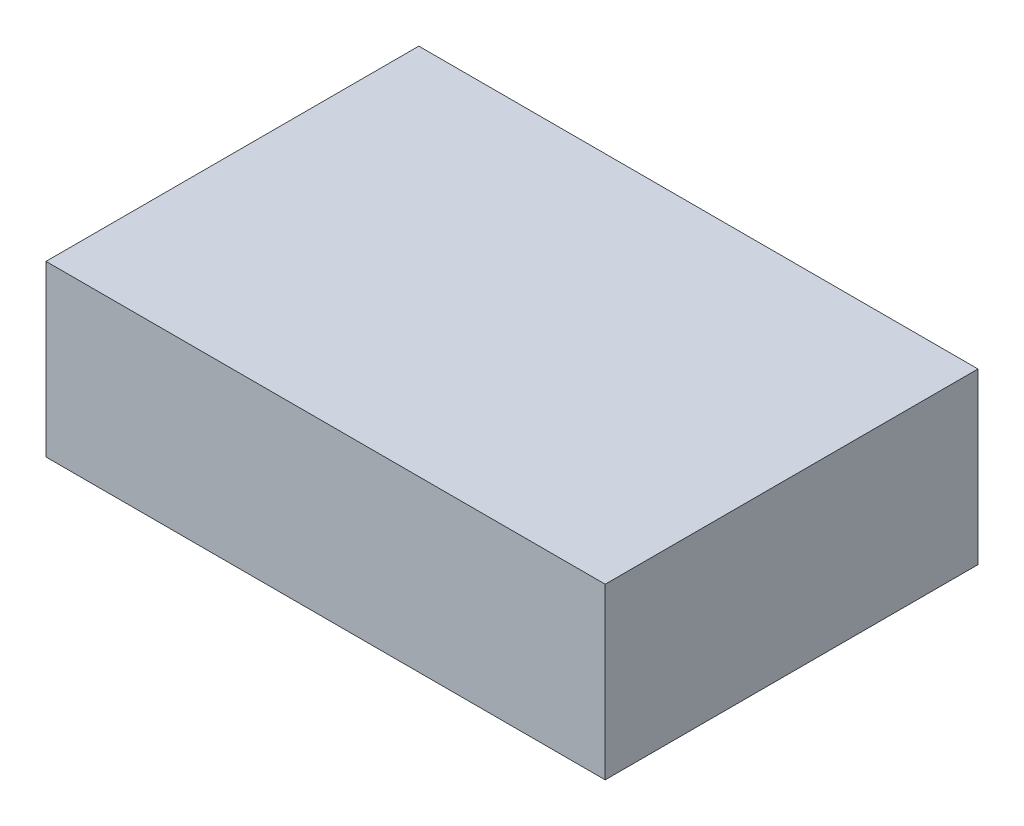
ISO-10303-21;
HEADER;
FILE_DESCRIPTION(('STEP AP214'),'2;1');
FILE_NAME('part.step','',(''),(''),'','','');
FILE_SCHEMA(('AUTOMOTIVE_DESIGN { 1 0 10303 214 1 1 1 1 }'));
ENDSEC;
DATA;
#1=APPLICATION_CONTEXT('core data for automotive mechanical design processes');
#2=APPLICATION_PROTOCOL_DEFINITION('international standard','automotive_design',2000,#1);
#3=PRODUCT_CONTEXT('',#1,'mechanical');
#4=PRODUCT('Part','Part','',(#3));
#5=PRODUCT_RELATED_PRODUCT_CATEGORY('part','',(#4));
#6=PRODUCT_DEFINITION_FORMATION('','',#4);
#7=PRODUCT_DEFINITION_CONTEXT('part definition',#1,'design');
#8=PRODUCT_DEFINITION('design','',#6,#7);
#9=PRODUCT_DEFINITION_SHAPE('','',#8);
#10=(LENGTH_UNIT() NAMED_UNIT(*) SI_UNIT(.MILLI.,.METRE.));
#11=(NAMED_UNIT(*) PLANE_ANGLE_UNIT() SI_UNIT($,.RADIAN.));
#12=(NAMED_UNIT(*) SI_UNIT($,.STERADIAN.) SOLID_ANGLE_UNIT());
#13=UNCERTAINTY_MEASURE_WITH_UNIT(LENGTH_MEASURE(1.E-05),#10,'distance_accuracy_value','');
#14=(GEOMETRIC_REPRESENTATION_CONTEXT(3) GLOBAL_UNCERTAINTY_ASSIGNED_CONTEXT((#13)) GLOBAL_UNIT_ASSIGNED_CONTEXT((#10,
#11,#12)) REPRESENTATION_CONTEXT('',''));
#15=CARTESIAN_POINT('',(0.,0.,0.));
#16=DIRECTION('',(0.,0.,1.));
#17=DIRECTION('',(1.,0.,0.));
#18=AXIS2_PLACEMENT_3D('',#15,#16,#17);
#19=CARTESIAN_POINT('',(33.,20.,22.));
#20=DIRECTION('',(-1.,0.,0.));
#21=DIRECTION('',(0.,0.,1.));
#22=AXIS2_PLACEMENT_3D('',#19,#20,#21);
#23=PLANE('',#22);
#24=DIRECTION('',(0.,0.,-1.));
#25=VECTOR('',#24,1.);
#26=CARTESIAN_POINT('',(33.,0.,22.));
#27=LINE('',#26,#25);
#28=CARTESIAN_POINT('',(33.,0.,22.));
#29=VERTEX_POINT('',#28);
#30=CARTESIAN_POINT('',(33.,0.,-22.));
#31=VERTEX_POINT('',#30);
#32=EDGE_CURVE('E99',#29,#31,#27,.T.);
#33=ORIENTED_EDGE('',*,*,#32,.T.);
#34=DIRECTION('',(0.,-1.,0.));
#35=VECTOR('',#34,1.);
#36=CARTESIAN_POINT('',(33.,20.,-22.));
#37=LINE('',#36,#35);
#38=CARTESIAN_POINT('',(33.,20.,-22.));
#39=VERTEX_POINT('',#38);
#40=EDGE_CURVE('E11',#39,#31,#37,.T.);
#41=ORIENTED_EDGE('',*,*,#40,.F.);
#42=DIRECTION('',(0.,0.,-1.));
#43=VECTOR('',#42,1.);
#44=CARTESIAN_POINT('',(33.,20.,22.));
#45=LINE('',#44,#43);
#46=CARTESIAN_POINT('',(33.,20.,22.));
#47=VERTEX_POINT('',#46);
#48=EDGE_CURVE('E87',#47,#39,#45,.T.);
#49=ORIENTED_EDGE('',*,*,#48,.F.);
#50=DIRECTION('',(0.,-1.,0.));
#51=VECTOR('',#50,1.);
#52=CARTESIAN_POINT('',(33.,20.,22.));
#53=LINE('',#52,#51);
#54=EDGE_CURVE('E95',#47,#29,#53,.T.);
#55=ORIENTED_EDGE('',*,*,#54,.T.);
#56=EDGE_LOOP('',(#33,#41,#49,#55));
#57=FACE_BOUND('',#56,.T.);
#58=ADVANCED_FACE('F36',(#57),#23,.F.);
#59=CARTESIAN_POINT('',(-33.,20.,-22.));
#60=DIRECTION('',(0.,0.,1.));
#61=DIRECTION('',(1.,0.,0.));
#62=AXIS2_PLACEMENT_3D('',#59,#60,#61);
#63=PLANE('',#62);
#64=DIRECTION('',(-1.,0.,0.));
#65=VECTOR('',#64,1.);
#66=CARTESIAN_POINT('',(-33.,0.,-22.));
#67=LINE('',#66,#65);
#68=CARTESIAN_POINT('',(-33.,0.,-22.));
#69=VERTEX_POINT('',#68);
#70=EDGE_CURVE('E91',#31,#69,#67,.T.);
#71=ORIENTED_EDGE('',*,*,#70,.T.);
#72=DIRECTION('',(0.,-1.,0.));
#73=VECTOR('',#72,1.);
#74=CARTESIAN_POINT('',(-33.,20.,-22.));
#75=LINE('',#74,#73);
#76=CARTESIAN_POINT('',(-33.,20.,-22.));
#77=VERTEX_POINT('',#76);
#78=EDGE_CURVE('E44',#77,#69,#75,.T.);
#79=ORIENTED_EDGE('',*,*,#78,.F.);
#80=DIRECTION('',(-1.,0.,0.));
#81=VECTOR('',#80,1.);
#82=CARTESIAN_POINT('',(-33.,20.,-22.));
#83=LINE('',#82,#81);
#84=EDGE_CURVE('E82',#39,#77,#83,.T.);
#85=ORIENTED_EDGE('',*,*,#84,.F.);
#86=ORIENTED_EDGE('',*,*,#40,.T.);
#87=EDGE_LOOP('',(#71,#79,#85,#86));
#88=FACE_BOUND('',#87,.T.);
#89=ADVANCED_FACE('F90',(#88),#63,.F.);
#90=CARTESIAN_POINT('',(-33.,20.,22.));
#91=DIRECTION('',(1.,0.,0.));
#92=DIRECTION('',(0.,0.,-1.));
#93=AXIS2_PLACEMENT_3D('',#90,#91,#92);
#94=PLANE('',#93);
#95=DIRECTION('',(0.,0.,1.));
#96=VECTOR('',#95,1.);
#97=CARTESIAN_POINT('',(-33.,0.,22.));
#98=LINE('',#97,#96);
#99=CARTESIAN_POINT('',(-33.,0.,22.));
#100=VERTEX_POINT('',#99);
#101=EDGE_CURVE('E69',#69,#100,#98,.T.);
#102=ORIENTED_EDGE('',*,*,#101,.T.);
#103=DIRECTION('',(0.,-1.,0.));
#104=VECTOR('',#103,1.);
#105=CARTESIAN_POINT('',(-33.,20.,22.));
#106=LINE('',#105,#104);
#107=CARTESIAN_POINT('',(-33.,20.,22.));
#108=VERTEX_POINT('',#107);
#109=EDGE_CURVE('E92',#108,#100,#106,.T.);
#110=ORIENTED_EDGE('',*,*,#109,.F.);
#111=DIRECTION('',(0.,0.,1.));
#112=VECTOR('',#111,1.);
#113=CARTESIAN_POINT('',(-33.,20.,22.));
#114=LINE('',#113,#112);
#115=EDGE_CURVE('E85',#77,#108,#114,.T.);
#116=ORIENTED_EDGE('',*,*,#115,.F.);
#117=ORIENTED_EDGE('',*,*,#78,.T.);
#118=EDGE_LOOP('',(#102,#110,#116,#117));
#119=FACE_BOUND('',#118,.T.);
#120=ADVANCED_FACE('F93',(#119),#94,.F.);
#121=CARTESIAN_POINT('',(-33.,20.,22.));
#122=DIRECTION('',(0.,0.,-1.));
#123=DIRECTION('',(-1.,0.,0.));
#124=AXIS2_PLACEMENT_3D('',#121,#122,#123);
#125=PLANE('',#124);
#126=DIRECTION('',(1.,0.,0.));
#127=VECTOR('',#126,1.);
#128=CARTESIAN_POINT('',(-33.,0.,22.));
#129=LINE('',#128,#127);
#130=EDGE_CURVE('E75',#100,#29,#129,.T.);
#131=ORIENTED_EDGE('',*,*,#130,.T.);
#132=ORIENTED_EDGE('',*,*,#54,.F.);
#133=DIRECTION('',(1.,0.,0.));
#134=VECTOR('',#133,1.);
#135=CARTESIAN_POINT('',(-33.,20.,22.));
#136=LINE('',#135,#134);
#137=EDGE_CURVE('E52',#108,#47,#136,.T.);
#138=ORIENTED_EDGE('',*,*,#137,.F.);
#139=ORIENTED_EDGE('',*,*,#109,.T.);
#140=EDGE_LOOP('',(#131,#132,#138,#139));
#141=FACE_BOUND('',#140,.T.);
#142=ADVANCED_FACE('F106',(#141),#125,.F.);
#143=CARTESIAN_POINT('',(0.,20.,0.));
#144=DIRECTION('',(0.,-1.,0.));
#145=DIRECTION('',(0.,0.,-1.));
#146=AXIS2_PLACEMENT_3D('',#143,#144,#145);
#147=PLANE('',#146);
#148=ORIENTED_EDGE('',*,*,#48,.T.);
#149=ORIENTED_EDGE('',*,*,#84,.T.);
#150=ORIENTED_EDGE('',*,*,#115,.T.);
#151=ORIENTED_EDGE('',*,*,#137,.T.);
#152=EDGE_LOOP('',(#148,#149,#150,#151));
#153=FACE_BOUND('',#152,.T.);
#154=ADVANCED_FACE('F83',(#153),#147,.F.);
#155=CARTESIAN_POINT('',(0.,0.,0.));
#156=DIRECTION('',(0.,-1.,0.));
#157=DIRECTION('',(0.,0.,-1.));
#158=AXIS2_PLACEMENT_3D('',#155,#156,#157);
#159=PLANE('',#158);
#160=ORIENTED_EDGE('',*,*,#32,.F.);
#161=ORIENTED_EDGE('',*,*,#130,.F.);
#162=ORIENTED_EDGE('',*,*,#101,.F.);
#163=ORIENTED_EDGE('',*,*,#70,.F.);
#164=EDGE_LOOP('',(#160,#161,#162,#163));
#165=FACE_BOUND('',#164,.T.);
#166=ADVANCED_FACE('F109',(#165),#159,.T.);
#167=CLOSED_SHELL('',(#58,#89,#120,#142,#154,#166));
#168=MANIFOLD_SOLID_BREP('B2',#167);
#169=ADVANCED_BREP_SHAPE_REPRESENTATION('',(#18,#168),#14);
#170=SHAPE_DEFINITION_REPRESENTATION(#9,#169);
ENDSEC;
END-ISO-10303-21;
